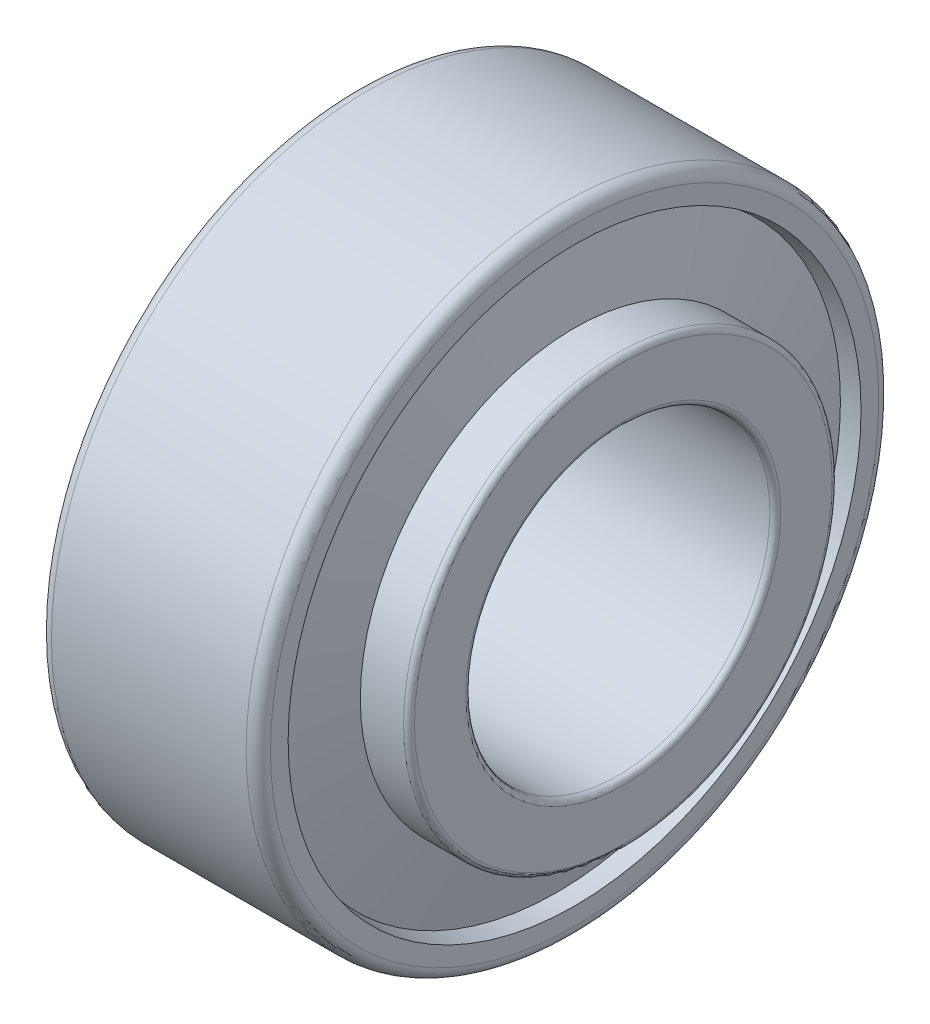
ISO-10303-21;
HEADER;
FILE_DESCRIPTION(('STEP AP214'),'2;1');
FILE_NAME('part.step','',(''),(''),'','','');
FILE_SCHEMA(('AUTOMOTIVE_DESIGN { 1 0 10303 214 1 1 1 1 }'));
ENDSEC;
DATA;
#1=APPLICATION_CONTEXT('core data for automotive mechanical design processes');
#2=APPLICATION_PROTOCOL_DEFINITION('international standard','automotive_design',2000,#1);
#3=PRODUCT_CONTEXT('',#1,'mechanical');
#4=PRODUCT('Part','Part','',(#3));
#5=PRODUCT_RELATED_PRODUCT_CATEGORY('part','',(#4));
#6=PRODUCT_DEFINITION_FORMATION('','',#4);
#7=PRODUCT_DEFINITION_CONTEXT('part definition',#1,'design');
#8=PRODUCT_DEFINITION('design','',#6,#7);
#9=PRODUCT_DEFINITION_SHAPE('','',#8);
#10=(LENGTH_UNIT() NAMED_UNIT(*) SI_UNIT(.MILLI.,.METRE.));
#11=(NAMED_UNIT(*) PLANE_ANGLE_UNIT() SI_UNIT($,.RADIAN.));
#12=(NAMED_UNIT(*) SI_UNIT($,.STERADIAN.) SOLID_ANGLE_UNIT());
#13=UNCERTAINTY_MEASURE_WITH_UNIT(LENGTH_MEASURE(1.E-05),#10,'distance_accuracy_value','');
#14=(GEOMETRIC_REPRESENTATION_CONTEXT(3) GLOBAL_UNCERTAINTY_ASSIGNED_CONTEXT((#13)) GLOBAL_UNIT_ASSIGNED_CONTEXT((#10,
#11,#12)) REPRESENTATION_CONTEXT('',''));
#15=CARTESIAN_POINT('',(0.,0.,0.));
#16=DIRECTION('',(0.,0.,1.));
#17=DIRECTION('',(1.,0.,0.));
#18=AXIS2_PLACEMENT_3D('',#15,#16,#17);
#19=CARTESIAN_POINT('',(1.75524784303871,0.,0.));
#20=DIRECTION('',(-1.,0.,0.));
#21=DIRECTION('',(0.,0.,1.));
#22=AXIS2_PLACEMENT_3D('',#19,#20,#21);
#23=CONICAL_SURFACE('',#22,20.5446208973575,1.34099464194898);
#24=CARTESIAN_POINT('',(3.51049568607731,0.,0.));
#25=DIRECTION('',(-1.,0.,0.));
#26=DIRECTION('',(0.,0.,1.));
#27=AXIS2_PLACEMENT_3D('',#24,#25,#26);
#28=CIRCLE('',#27,13.0414513813677);
#29=CARTESIAN_POINT('',(3.51049568607731,0.,13.0414513813677));
#30=VERTEX_POINT('',#29);
#31=EDGE_CURVE('E112',#30,#30,#28,.T.);
#32=ORIENTED_EDGE('',*,*,#31,.F.);
#33=EDGE_LOOP('',(#32));
#34=FACE_BOUND('',#33,.T.);
#35=CARTESIAN_POINT('',(1.75524784303871,0.,0.));
#36=DIRECTION('',(-1.,0.,0.));
#37=DIRECTION('',(0.,0.,1.));
#38=AXIS2_PLACEMENT_3D('',#35,#36,#37);
#39=CIRCLE('',#38,20.5446208973575);
#40=CARTESIAN_POINT('',(1.75524784303871,0.,20.5446208973575));
#41=VERTEX_POINT('',#40);
#42=EDGE_CURVE('E10',#41,#41,#39,.T.);
#43=ORIENTED_EDGE('',*,*,#42,.T.);
#44=EDGE_LOOP('',(#43));
#45=FACE_BOUND('',#44,.T.);
#46=ADVANCED_FACE('F37',(#34,#45),#23,.F.);
#47=CARTESIAN_POINT('',(0.,0.,0.));
#48=DIRECTION('',(1.,0.,0.));
#49=DIRECTION('',(0.,0.,-1.));
#50=AXIS2_PLACEMENT_3D('',#47,#48,#49);
#51=CONICAL_SURFACE('',#50,20.2205,0.182601251576093);
#52=ORIENTED_EDGE('',*,*,#42,.F.);
#53=EDGE_LOOP('',(#52));
#54=FACE_BOUND('',#53,.T.);
#55=CARTESIAN_POINT('',(0.,0.,0.));
#56=DIRECTION('',(-1.,0.,0.));
#57=DIRECTION('',(0.,0.,1.));
#58=AXIS2_PLACEMENT_3D('',#55,#56,#57);
#59=CIRCLE('',#58,20.2205);
#60=CARTESIAN_POINT('',(0.,0.,20.2205));
#61=VERTEX_POINT('',#60);
#62=EDGE_CURVE('E44',#61,#61,#59,.T.);
#63=ORIENTED_EDGE('',*,*,#62,.T.);
#64=EDGE_LOOP('',(#63));
#65=FACE_BOUND('',#64,.T.);
#66=ADVANCED_FACE('F120',(#54,#65),#51,.F.);
#67=CARTESIAN_POINT('',(0.,20.2205,0.));
#68=DIRECTION('',(1.,0.,0.));
#69=DIRECTION('',(0.,0.,-1.));
#70=AXIS2_PLACEMENT_3D('',#67,#68,#69);
#71=PLANE('',#70);
#72=ORIENTED_EDGE('',*,*,#62,.F.);
#73=EDGE_LOOP('',(#72));
#74=FACE_BOUND('',#73,.T.);
#75=CARTESIAN_POINT('',(0.,0.,0.));
#76=DIRECTION('',(-1.,0.,0.));
#77=DIRECTION('',(0.,0.,1.));
#78=AXIS2_PLACEMENT_3D('',#75,#76,#77);
#79=CIRCLE('',#78,25.);
#80=CARTESIAN_POINT('',(0.,0.,25.));
#81=VERTEX_POINT('',#80);
#82=EDGE_CURVE('E49',#81,#81,#79,.T.);
#83=ORIENTED_EDGE('',*,*,#82,.T.);
#84=EDGE_LOOP('',(#83));
#85=FACE_BOUND('',#84,.T.);
#86=ADVANCED_FACE('F124',(#74,#85),#71,.F.);
#87=CARTESIAN_POINT('',(1.,0.,0.));
#88=DIRECTION('',(-1.,0.,0.));
#89=DIRECTION('',(0.,0.,1.));
#90=AXIS2_PLACEMENT_3D('',#87,#88,#89);
#91=TOROIDAL_SURFACE('',#90,25.,1.);
#92=ORIENTED_EDGE('',*,*,#82,.F.);
#93=EDGE_LOOP('',(#92));
#94=FACE_BOUND('',#93,.T.);
#95=CARTESIAN_POINT('',(1.,0.,0.));
#96=DIRECTION('',(-1.,0.,0.));
#97=DIRECTION('',(0.,0.,1.));
#98=AXIS2_PLACEMENT_3D('',#95,#96,#97);
#99=CIRCLE('',#98,26.);
#100=CARTESIAN_POINT('',(1.,0.,26.));
#101=VERTEX_POINT('',#100);
#102=EDGE_CURVE('E54',#101,#101,#99,.T.);
#103=ORIENTED_EDGE('',*,*,#102,.T.);
#104=EDGE_LOOP('',(#103));
#105=FACE_BOUND('',#104,.T.);
#106=ADVANCED_FACE('F129',(#94,#105),#91,.T.);
#107=CARTESIAN_POINT('',(-882.527700014444,0.,0.));
#108=DIRECTION('',(-1.,0.,0.));
#109=DIRECTION('',(0.,0.,1.));
#110=AXIS2_PLACEMENT_3D('',#107,#108,#109);
#111=CYLINDRICAL_SURFACE('',#110,26.);
#112=ORIENTED_EDGE('',*,*,#102,.F.);
#113=EDGE_LOOP('',(#112));
#114=FACE_BOUND('',#113,.T.);
#115=CARTESIAN_POINT('',(17.,0.,0.));
#116=DIRECTION('',(-1.,0.,0.));
#117=DIRECTION('',(0.,0.,1.));
#118=AXIS2_PLACEMENT_3D('',#115,#116,#117);
#119=CIRCLE('',#118,26.);
#120=CARTESIAN_POINT('',(17.,0.,26.));
#121=VERTEX_POINT('',#120);
#122=EDGE_CURVE('E60',#121,#121,#119,.T.);
#123=ORIENTED_EDGE('',*,*,#122,.T.);
#124=EDGE_LOOP('',(#123));
#125=FACE_BOUND('',#124,.T.);
#126=ADVANCED_FACE('F135',(#114,#125),#111,.T.);
#127=CARTESIAN_POINT('',(17.,0.,0.));
#128=DIRECTION('',(-1.,0.,0.));
#129=DIRECTION('',(0.,0.,1.));
#130=AXIS2_PLACEMENT_3D('',#127,#128,#129);
#131=TOROIDAL_SURFACE('',#130,25.,1.);
#132=ORIENTED_EDGE('',*,*,#122,.F.);
#133=EDGE_LOOP('',(#132));
#134=FACE_BOUND('',#133,.T.);
#135=CARTESIAN_POINT('',(18.,0.,0.));
#136=DIRECTION('',(-1.,0.,0.));
#137=DIRECTION('',(0.,0.,1.));
#138=AXIS2_PLACEMENT_3D('',#135,#136,#137);
#139=CIRCLE('',#138,25.);
#140=CARTESIAN_POINT('',(18.,0.,25.));
#141=VERTEX_POINT('',#140);
#142=EDGE_CURVE('E64',#141,#141,#139,.T.);
#143=ORIENTED_EDGE('',*,*,#142,.T.);
#144=EDGE_LOOP('',(#143));
#145=FACE_BOUND('',#144,.T.);
#146=ADVANCED_FACE('F139',(#134,#145),#131,.T.);
#147=CARTESIAN_POINT('',(18.,25.,0.));
#148=DIRECTION('',(-1.,0.,0.));
#149=DIRECTION('',(0.,0.,1.));
#150=AXIS2_PLACEMENT_3D('',#147,#148,#149);
#151=PLANE('',#150);
#152=ORIENTED_EDGE('',*,*,#142,.F.);
#153=EDGE_LOOP('',(#152));
#154=FACE_BOUND('',#153,.T.);
#155=CARTESIAN_POINT('',(18.,0.,0.));
#156=DIRECTION('',(-1.,0.,0.));
#157=DIRECTION('',(0.,0.,1.));
#158=AXIS2_PLACEMENT_3D('',#155,#156,#157);
#159=CIRCLE('',#158,23.5443474985588);
#160=CARTESIAN_POINT('',(18.,0.,23.5443474985588));
#161=VERTEX_POINT('',#160);
#162=EDGE_CURVE('E68',#161,#161,#159,.T.);
#163=ORIENTED_EDGE('',*,*,#162,.T.);
#164=EDGE_LOOP('',(#163));
#165=FACE_BOUND('',#164,.T.);
#166=ADVANCED_FACE('F143',(#154,#165),#151,.F.);
#167=CARTESIAN_POINT('',(16.5685482108422,0.,0.));
#168=DIRECTION('',(1.,0.,0.));
#169=DIRECTION('',(0.,0.,-1.));
#170=AXIS2_PLACEMENT_3D('',#167,#168,#169);
#171=CONICAL_SURFACE('',#170,23.2800181958533,0.182601251576099);
#172=ORIENTED_EDGE('',*,*,#162,.F.);
#173=EDGE_LOOP('',(#172));
#174=FACE_BOUND('',#173,.T.);
#175=CARTESIAN_POINT('',(16.5685482108422,0.,0.));
#176=DIRECTION('',(-1.,0.,0.));
#177=DIRECTION('',(0.,0.,1.));
#178=AXIS2_PLACEMENT_3D('',#175,#176,#177);
#179=CIRCLE('',#178,23.2800181958533);
#180=CARTESIAN_POINT('',(16.5685482108422,0.,23.2800181958533));
#181=VERTEX_POINT('',#180);
#182=EDGE_CURVE('E72',#181,#181,#179,.T.);
#183=ORIENTED_EDGE('',*,*,#182,.T.);
#184=EDGE_LOOP('',(#183));
#185=FACE_BOUND('',#184,.T.);
#186=ADVANCED_FACE('F147',(#174,#185),#171,.F.);
#187=CARTESIAN_POINT('',(18.,0.,0.));
#188=DIRECTION('',(-1.,0.,0.));
#189=DIRECTION('',(0.,0.,1.));
#190=AXIS2_PLACEMENT_3D('',#187,#188,#189);
#191=CONICAL_SURFACE('',#190,17.1609818041467,1.34099464194898);
#192=ORIENTED_EDGE('',*,*,#182,.F.);
#193=EDGE_LOOP('',(#192));
#194=FACE_BOUND('',#193,.T.);
#195=CARTESIAN_POINT('',(18.,0.,0.));
#196=DIRECTION('',(-1.,0.,0.));
#197=DIRECTION('',(0.,0.,1.));
#198=AXIS2_PLACEMENT_3D('',#195,#196,#197);
#199=CIRCLE('',#198,17.1609818041467);
#200=CARTESIAN_POINT('',(18.,0.,17.1609818041467));
#201=VERTEX_POINT('',#200);
#202=EDGE_CURVE('E76',#201,#201,#199,.T.);
#203=ORIENTED_EDGE('',*,*,#202,.T.);
#204=EDGE_LOOP('',(#203));
#205=FACE_BOUND('',#204,.T.);
#206=ADVANCED_FACE('F151',(#194,#205),#191,.T.);
#207=CARTESIAN_POINT('',(18.,17.6109818041467,0.));
#208=DIRECTION('',(1.,0.,0.));
#209=DIRECTION('',(0.,0.,-1.));
#210=AXIS2_PLACEMENT_3D('',#207,#208,#209);
#211=PLANE('',#210);
#212=ORIENTED_EDGE('',*,*,#202,.F.);
#213=EDGE_LOOP('',(#212));
#214=FACE_BOUND('',#213,.T.);
#215=CARTESIAN_POINT('',(18.,0.,0.));
#216=DIRECTION('',(-1.,0.,0.));
#217=DIRECTION('',(0.,0.,1.));
#218=AXIS2_PLACEMENT_3D('',#215,#216,#217);
#219=CIRCLE('',#218,17.6109818041467);
#220=CARTESIAN_POINT('',(18.,0.,17.6109818041467));
#221=VERTEX_POINT('',#220);
#222=EDGE_CURVE('E80',#221,#221,#219,.T.);
#223=ORIENTED_EDGE('',*,*,#222,.T.);
#224=EDGE_LOOP('',(#223));
#225=FACE_BOUND('',#224,.T.);
#226=ADVANCED_FACE('F155',(#214,#225),#211,.F.);
#227=CARTESIAN_POINT('',(-882.527700014444,0.,0.));
#228=DIRECTION('',(-1.,0.,0.));
#229=DIRECTION('',(0.,0.,1.));
#230=AXIS2_PLACEMENT_3D('',#227,#228,#229);
#231=CYLINDRICAL_SURFACE('',#230,17.6109818041467);
#232=ORIENTED_EDGE('',*,*,#222,.F.);
#233=EDGE_LOOP('',(#232));
#234=FACE_BOUND('',#233,.T.);
#235=CARTESIAN_POINT('',(21.55,0.,0.));
#236=DIRECTION('',(-1.,0.,0.));
#237=DIRECTION('',(0.,0.,1.));
#238=AXIS2_PLACEMENT_3D('',#235,#236,#237);
#239=CIRCLE('',#238,17.6109818041467);
#240=CARTESIAN_POINT('',(21.55,0.,17.6109818041467));
#241=VERTEX_POINT('',#240);
#242=EDGE_CURVE('E84',#241,#241,#239,.T.);
#243=ORIENTED_EDGE('',*,*,#242,.T.);
#244=EDGE_LOOP('',(#243));
#245=FACE_BOUND('',#244,.T.);
#246=ADVANCED_FACE('F159',(#234,#245),#231,.T.);
#247=CARTESIAN_POINT('',(21.55,0.,0.));
#248=DIRECTION('',(-1.,0.,0.));
#249=DIRECTION('',(0.,0.,1.));
#250=AXIS2_PLACEMENT_3D('',#247,#248,#249);
#251=TOROIDAL_SURFACE('',#250,17.1609818041467,0.450000000000001);
#252=ORIENTED_EDGE('',*,*,#242,.F.);
#253=EDGE_LOOP('',(#252));
#254=FACE_BOUND('',#253,.T.);
#255=CARTESIAN_POINT('',(22.,0.,0.));
#256=DIRECTION('',(-1.,0.,0.));
#257=DIRECTION('',(0.,0.,1.));
#258=AXIS2_PLACEMENT_3D('',#255,#256,#257);
#259=CIRCLE('',#258,17.1609818041467);
#260=CARTESIAN_POINT('',(22.,0.,17.1609818041467));
#261=VERTEX_POINT('',#260);
#262=EDGE_CURVE('E88',#261,#261,#259,.T.);
#263=ORIENTED_EDGE('',*,*,#262,.T.);
#264=EDGE_LOOP('',(#263));
#265=FACE_BOUND('',#264,.T.);
#266=ADVANCED_FACE('F163',(#254,#265),#251,.T.);
#267=CARTESIAN_POINT('',(22.,12.95,0.));
#268=DIRECTION('',(-1.,0.,0.));
#269=DIRECTION('',(0.,0.,1.));
#270=AXIS2_PLACEMENT_3D('',#267,#268,#269);
#271=PLANE('',#270);
#272=ORIENTED_EDGE('',*,*,#262,.F.);
#273=EDGE_LOOP('',(#272));
#274=FACE_BOUND('',#273,.T.);
#275=CARTESIAN_POINT('',(22.,0.,0.));
#276=DIRECTION('',(-1.,0.,0.));
#277=DIRECTION('',(0.,0.,1.));
#278=AXIS2_PLACEMENT_3D('',#275,#276,#277);
#279=CIRCLE('',#278,12.95);
#280=CARTESIAN_POINT('',(22.,0.,12.95));
#281=VERTEX_POINT('',#280);
#282=EDGE_CURVE('E92',#281,#281,#279,.T.);
#283=ORIENTED_EDGE('',*,*,#282,.T.);
#284=EDGE_LOOP('',(#283));
#285=FACE_BOUND('',#284,.T.);
#286=ADVANCED_FACE('F167',(#274,#285),#271,.F.);
#287=CARTESIAN_POINT('',(21.55,0.,0.));
#288=DIRECTION('',(-1.,0.,0.));
#289=DIRECTION('',(0.,0.,1.));
#290=AXIS2_PLACEMENT_3D('',#287,#288,#289);
#291=TOROIDAL_SURFACE('',#290,12.95,0.450000000000003);
#292=ORIENTED_EDGE('',*,*,#282,.F.);
#293=EDGE_LOOP('',(#292));
#294=FACE_BOUND('',#293,.T.);
#295=CARTESIAN_POINT('',(21.55,0.,0.));
#296=DIRECTION('',(-1.,0.,0.));
#297=DIRECTION('',(0.,0.,1.));
#298=AXIS2_PLACEMENT_3D('',#295,#296,#297);
#299=CIRCLE('',#298,12.5);
#300=CARTESIAN_POINT('',(21.55,0.,12.5));
#301=VERTEX_POINT('',#300);
#302=EDGE_CURVE('E96',#301,#301,#299,.T.);
#303=ORIENTED_EDGE('',*,*,#302,.T.);
#304=EDGE_LOOP('',(#303));
#305=FACE_BOUND('',#304,.T.);
#306=ADVANCED_FACE('F171',(#294,#305),#291,.T.);
#307=CARTESIAN_POINT('',(-882.527700014444,0.,0.));
#308=DIRECTION('',(-1.,0.,0.));
#309=DIRECTION('',(0.,0.,1.));
#310=AXIS2_PLACEMENT_3D('',#307,#308,#309);
#311=CYLINDRICAL_SURFACE('',#310,12.5);
#312=ORIENTED_EDGE('',*,*,#302,.F.);
#313=EDGE_LOOP('',(#312));
#314=FACE_BOUND('',#313,.T.);
#315=CARTESIAN_POINT('',(0.44999999999995,0.,0.));
#316=DIRECTION('',(-1.,0.,0.));
#317=DIRECTION('',(0.,0.,1.));
#318=AXIS2_PLACEMENT_3D('',#315,#316,#317);
#319=CIRCLE('',#318,12.5);
#320=CARTESIAN_POINT('',(0.44999999999995,0.,12.5));
#321=VERTEX_POINT('',#320);
#322=EDGE_CURVE('E100',#321,#321,#319,.T.);
#323=ORIENTED_EDGE('',*,*,#322,.T.);
#324=EDGE_LOOP('',(#323));
#325=FACE_BOUND('',#324,.T.);
#326=ADVANCED_FACE('F175',(#314,#325),#311,.F.);
#327=CARTESIAN_POINT('',(0.45,0.,0.));
#328=DIRECTION('',(-1.,0.,0.));
#329=DIRECTION('',(0.,0.,1.));
#330=AXIS2_PLACEMENT_3D('',#327,#328,#329);
#331=TOROIDAL_SURFACE('',#330,12.95,0.450000000000001);
#332=ORIENTED_EDGE('',*,*,#322,.F.);
#333=EDGE_LOOP('',(#332));
#334=FACE_BOUND('',#333,.T.);
#335=CARTESIAN_POINT('',(0.,0.,0.));
#336=DIRECTION('',(-1.,0.,0.));
#337=DIRECTION('',(0.,0.,1.));
#338=AXIS2_PLACEMENT_3D('',#335,#336,#337);
#339=CIRCLE('',#338,12.95);
#340=CARTESIAN_POINT('',(0.,0.,12.95));
#341=VERTEX_POINT('',#340);
#342=EDGE_CURVE('E104',#341,#341,#339,.T.);
#343=ORIENTED_EDGE('',*,*,#342,.T.);
#344=EDGE_LOOP('',(#343));
#345=FACE_BOUND('',#344,.T.);
#346=ADVANCED_FACE('F179',(#334,#345),#331,.T.);
#347=CARTESIAN_POINT('',(0.,13.0414513813677,0.));
#348=DIRECTION('',(1.,0.,0.));
#349=DIRECTION('',(0.,0.,-1.));
#350=AXIS2_PLACEMENT_3D('',#347,#348,#349);
#351=PLANE('',#350);
#352=ORIENTED_EDGE('',*,*,#342,.F.);
#353=EDGE_LOOP('',(#352));
#354=FACE_BOUND('',#353,.T.);
#355=CARTESIAN_POINT('',(0.,0.,0.));
#356=DIRECTION('',(-1.,0.,0.));
#357=DIRECTION('',(0.,0.,1.));
#358=AXIS2_PLACEMENT_3D('',#355,#356,#357);
#359=CIRCLE('',#358,13.0414513813677);
#360=CARTESIAN_POINT('',(0.,0.,13.0414513813677));
#361=VERTEX_POINT('',#360);
#362=EDGE_CURVE('E108',#361,#361,#359,.T.);
#363=ORIENTED_EDGE('',*,*,#362,.T.);
#364=EDGE_LOOP('',(#363));
#365=FACE_BOUND('',#364,.T.);
#366=ADVANCED_FACE('F183',(#354,#365),#351,.F.);
#367=CARTESIAN_POINT('',(-882.527700014444,0.,0.));
#368=DIRECTION('',(-1.,0.,0.));
#369=DIRECTION('',(0.,0.,1.));
#370=AXIS2_PLACEMENT_3D('',#367,#368,#369);
#371=CYLINDRICAL_SURFACE('',#370,13.0414513813677);
#372=ORIENTED_EDGE('',*,*,#362,.F.);
#373=EDGE_LOOP('',(#372));
#374=FACE_BOUND('',#373,.T.);
#375=ORIENTED_EDGE('',*,*,#31,.T.);
#376=EDGE_LOOP('',(#375));
#377=FACE_BOUND('',#376,.T.);
#378=ADVANCED_FACE('F117',(#374,#377),#371,.T.);
#379=CLOSED_SHELL('',(#46,#66,#86,#106,#126,#146,#166,#186,#206,#226,#246,#266,#286,#306,#326,
#346,#366,#378));
#380=MANIFOLD_SOLID_BREP('B2',#379);
#381=ADVANCED_BREP_SHAPE_REPRESENTATION('',(#18,#380),#14);
#382=SHAPE_DEFINITION_REPRESENTATION(#9,#381);
ENDSEC;
END-ISO-10303-21;
